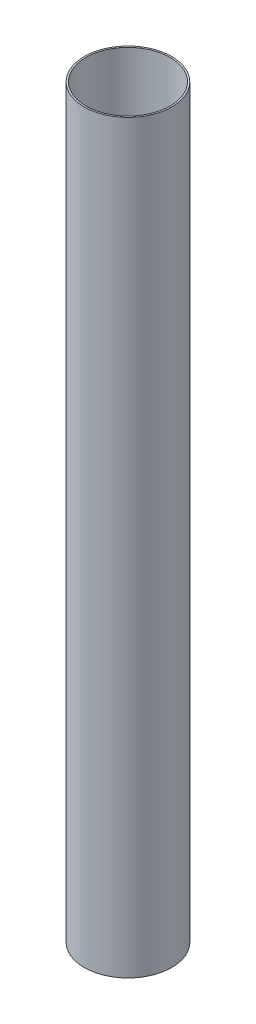
ISO-10303-21;
HEADER;
FILE_DESCRIPTION(('STEP AP214'),'2;1');
FILE_NAME('part.step','',(''),(''),'','','');
FILE_SCHEMA(('AUTOMOTIVE_DESIGN { 1 0 10303 214 1 1 1 1 }'));
ENDSEC;
DATA;
#1=APPLICATION_CONTEXT('core data for automotive mechanical design processes');
#2=APPLICATION_PROTOCOL_DEFINITION('international standard','automotive_design',2000,#1);
#3=PRODUCT_CONTEXT('',#1,'mechanical');
#4=PRODUCT('Part','Part','',(#3));
#5=PRODUCT_RELATED_PRODUCT_CATEGORY('part','',(#4));
#6=PRODUCT_DEFINITION_FORMATION('','',#4);
#7=PRODUCT_DEFINITION_CONTEXT('part definition',#1,'design');
#8=PRODUCT_DEFINITION('design','',#6,#7);
#9=PRODUCT_DEFINITION_SHAPE('','',#8);
#10=(LENGTH_UNIT() NAMED_UNIT(*) SI_UNIT(.MILLI.,.METRE.));
#11=(NAMED_UNIT(*) PLANE_ANGLE_UNIT() SI_UNIT($,.RADIAN.));
#12=(NAMED_UNIT(*) SI_UNIT($,.STERADIAN.) SOLID_ANGLE_UNIT());
#13=UNCERTAINTY_MEASURE_WITH_UNIT(LENGTH_MEASURE(1.E-05),#10,'distance_accuracy_value','');
#14=(GEOMETRIC_REPRESENTATION_CONTEXT(3) GLOBAL_UNCERTAINTY_ASSIGNED_CONTEXT((#13)) GLOBAL_UNIT_ASSIGNED_CONTEXT((#10,
#11,#12)) REPRESENTATION_CONTEXT('',''));
#15=CARTESIAN_POINT('',(0.,0.,0.));
#16=DIRECTION('',(0.,0.,1.));
#17=DIRECTION('',(1.,0.,0.));
#18=AXIS2_PLACEMENT_3D('',#15,#16,#17);
#19=CARTESIAN_POINT('',(0.,460.,0.));
#20=DIRECTION('',(0.,-1.,0.));
#21=DIRECTION('',(0.,0.,-1.));
#22=AXIS2_PLACEMENT_3D('',#19,#20,#21);
#23=CYLINDRICAL_SURFACE('',#22,27.);
#24=CARTESIAN_POINT('',(0.,460.,0.));
#25=DIRECTION('',(0.,1.,0.));
#26=DIRECTION('',(0.,0.,1.));
#27=AXIS2_PLACEMENT_3D('',#24,#25,#26);
#28=CIRCLE('',#27,27.);
#29=CARTESIAN_POINT('',(0.,460.,27.));
#30=VERTEX_POINT('',#29);
#31=EDGE_CURVE('E10',#30,#30,#28,.T.);
#32=ORIENTED_EDGE('',*,*,#31,.F.);
#33=EDGE_LOOP('',(#32));
#34=FACE_BOUND('',#33,.T.);
#35=CARTESIAN_POINT('',(0.,0.,0.));
#36=DIRECTION('',(0.,1.,0.));
#37=DIRECTION('',(0.,0.,1.));
#38=AXIS2_PLACEMENT_3D('',#35,#36,#37);
#39=CIRCLE('',#38,27.);
#40=CARTESIAN_POINT('',(0.,0.,27.));
#41=VERTEX_POINT('',#40);
#42=EDGE_CURVE('E36',#41,#41,#39,.T.);
#43=ORIENTED_EDGE('',*,*,#42,.T.);
#44=EDGE_LOOP('',(#43));
#45=FACE_BOUND('',#44,.T.);
#46=ADVANCED_FACE('F33',(#34,#45),#23,.T.);
#47=CARTESIAN_POINT('',(0.,460.,0.));
#48=DIRECTION('',(0.,1.,0.));
#49=DIRECTION('',(0.,0.,1.));
#50=AXIS2_PLACEMENT_3D('',#47,#48,#49);
#51=PLANE('',#50);
#52=CARTESIAN_POINT('',(0.,460.,0.));
#53=DIRECTION('',(0.,1.,0.));
#54=DIRECTION('',(0.,0.,1.));
#55=AXIS2_PLACEMENT_3D('',#52,#53,#54);
#56=CIRCLE('',#55,26.);
#57=CARTESIAN_POINT('',(0.,460.,26.));
#58=VERTEX_POINT('',#57);
#59=EDGE_CURVE('E43',#58,#58,#56,.T.);
#60=ORIENTED_EDGE('',*,*,#59,.F.);
#61=EDGE_LOOP('',(#60));
#62=FACE_BOUND('',#61,.T.);
#63=ORIENTED_EDGE('',*,*,#31,.T.);
#64=EDGE_LOOP('',(#63));
#65=FACE_BOUND('',#64,.T.);
#66=ADVANCED_FACE('F54',(#62,#65),#51,.T.);
#67=CARTESIAN_POINT('',(0.,0.,0.));
#68=DIRECTION('',(0.,1.,0.));
#69=DIRECTION('',(0.,0.,1.));
#70=AXIS2_PLACEMENT_3D('',#67,#68,#69);
#71=PLANE('',#70);
#72=CARTESIAN_POINT('',(0.,0.,0.));
#73=DIRECTION('',(0.,1.,0.));
#74=DIRECTION('',(0.,0.,1.));
#75=AXIS2_PLACEMENT_3D('',#72,#73,#74);
#76=CIRCLE('',#75,26.);
#77=CARTESIAN_POINT('',(0.,0.,26.));
#78=VERTEX_POINT('',#77);
#79=EDGE_CURVE('E45',#78,#78,#76,.T.);
#80=ORIENTED_EDGE('',*,*,#79,.T.);
#81=EDGE_LOOP('',(#80));
#82=FACE_BOUND('',#81,.T.);
#83=ORIENTED_EDGE('',*,*,#42,.F.);
#84=EDGE_LOOP('',(#83));
#85=FACE_BOUND('',#84,.T.);
#86=ADVANCED_FACE('F56',(#82,#85),#71,.F.);
#87=CARTESIAN_POINT('',(0.,460.,0.));
#88=DIRECTION('',(0.,-1.,0.));
#89=DIRECTION('',(0.,0.,-1.));
#90=AXIS2_PLACEMENT_3D('',#87,#88,#89);
#91=CYLINDRICAL_SURFACE('',#90,26.);
#92=ORIENTED_EDGE('',*,*,#59,.T.);
#93=EDGE_LOOP('',(#92));
#94=FACE_BOUND('',#93,.T.);
#95=ORIENTED_EDGE('',*,*,#79,.F.);
#96=EDGE_LOOP('',(#95));
#97=FACE_BOUND('',#96,.T.);
#98=ADVANCED_FACE('F51',(#94,#97),#91,.F.);
#99=CLOSED_SHELL('',(#46,#66,#86,#98));
#100=MANIFOLD_SOLID_BREP('B2',#99);
#101=ADVANCED_BREP_SHAPE_REPRESENTATION('',(#18,#100),#14);
#102=SHAPE_DEFINITION_REPRESENTATION(#9,#101);
ENDSEC;
END-ISO-10303-21;
